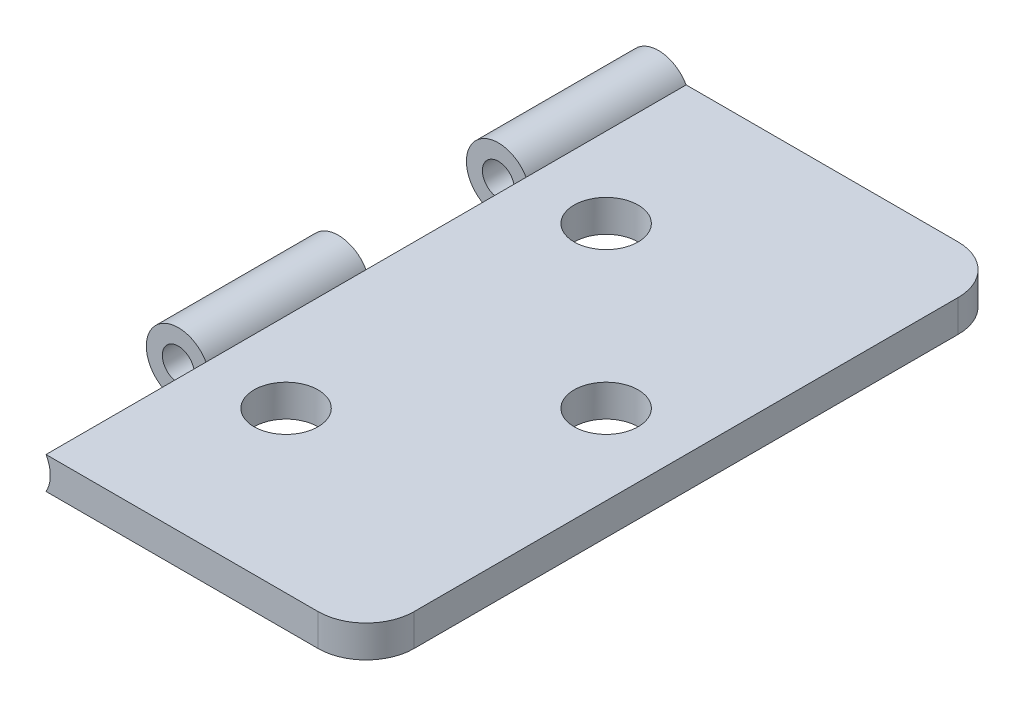
ISO-10303-21;
HEADER;
FILE_DESCRIPTION(('STEP AP214'),'2;1');
FILE_NAME('part.step','',(''),(''),'','','');
FILE_SCHEMA(('AUTOMOTIVE_DESIGN { 1 0 10303 214 1 1 1 1 }'));
ENDSEC;
DATA;
#1=APPLICATION_CONTEXT('core data for automotive mechanical design processes');
#2=APPLICATION_PROTOCOL_DEFINITION('international standard','automotive_design',2000,#1);
#3=PRODUCT_CONTEXT('',#1,'mechanical');
#4=PRODUCT('Part','Part','',(#3));
#5=PRODUCT_RELATED_PRODUCT_CATEGORY('part','',(#4));
#6=PRODUCT_DEFINITION_FORMATION('','',#4);
#7=PRODUCT_DEFINITION_CONTEXT('part definition',#1,'design');
#8=PRODUCT_DEFINITION('design','',#6,#7);
#9=PRODUCT_DEFINITION_SHAPE('','',#8);
#10=(LENGTH_UNIT() NAMED_UNIT(*) SI_UNIT(.MILLI.,.METRE.));
#11=(NAMED_UNIT(*) PLANE_ANGLE_UNIT() SI_UNIT($,.RADIAN.));
#12=(NAMED_UNIT(*) SI_UNIT($,.STERADIAN.) SOLID_ANGLE_UNIT());
#13=UNCERTAINTY_MEASURE_WITH_UNIT(LENGTH_MEASURE(1.E-05),#10,'distance_accuracy_value','');
#14=(GEOMETRIC_REPRESENTATION_CONTEXT(3) GLOBAL_UNCERTAINTY_ASSIGNED_CONTEXT((#13)) GLOBAL_UNIT_ASSIGNED_CONTEXT((#10,
#11,#12)) REPRESENTATION_CONTEXT('',''));
#15=CARTESIAN_POINT('',(0.,0.,0.));
#16=DIRECTION('',(0.,0.,1.));
#17=DIRECTION('',(1.,0.,0.));
#18=AXIS2_PLACEMENT_3D('',#15,#16,#17);
#19=CARTESIAN_POINT('',(11.7090081334901,-1.,-40.));
#20=DIRECTION('',(0.,0.,1.));
#21=DIRECTION('',(1.,0.,0.));
#22=AXIS2_PLACEMENT_3D('',#19,#20,#21);
#23=CYLINDRICAL_SURFACE('',#22,2.);
#24=DIRECTION('',(0.,0.,1.));
#25=VECTOR('',#24,1.);
#26=CARTESIAN_POINT('',(13.441058941059,0.,-40.));
#27=LINE('',#26,#25);
#28=CARTESIAN_POINT('',(13.441058941059,0.,-30.));
#29=VERTEX_POINT('',#28);
#30=CARTESIAN_POINT('',(13.441058941059,0.,-20.));
#31=VERTEX_POINT('',#30);
#32=EDGE_CURVE('E177',#29,#31,#27,.T.);
#33=ORIENTED_EDGE('',*,*,#32,.F.);
#34=CARTESIAN_POINT('',(11.7090081334901,-1.,-30.));
#35=DIRECTION('',(0.,0.,1.));
#36=DIRECTION('',(1.,0.,0.));
#37=AXIS2_PLACEMENT_3D('',#34,#35,#36);
#38=CIRCLE('',#37,2.);
#39=CARTESIAN_POINT('',(13.441058941059,-2.,-30.));
#40=VERTEX_POINT('',#39);
#41=EDGE_CURVE('E281',#40,#29,#38,.T.);
#42=ORIENTED_EDGE('',*,*,#41,.F.);
#43=DIRECTION('',(0.,0.,1.));
#44=VECTOR('',#43,1.);
#45=CARTESIAN_POINT('',(13.441058941059,-2.,-40.));
#46=LINE('',#45,#44);
#47=CARTESIAN_POINT('',(13.441058941059,-2.,-20.));
#48=VERTEX_POINT('',#47);
#49=EDGE_CURVE('E137',#40,#48,#46,.T.);
#50=ORIENTED_EDGE('',*,*,#49,.T.);
#51=CARTESIAN_POINT('',(11.7090081334901,-1.,-20.));
#52=DIRECTION('',(0.,0.,1.));
#53=DIRECTION('',(1.,0.,0.));
#54=AXIS2_PLACEMENT_3D('',#51,#52,#53);
#55=CIRCLE('',#54,2.);
#56=EDGE_CURVE('E195',#48,#31,#55,.T.);
#57=ORIENTED_EDGE('',*,*,#56,.T.);
#58=EDGE_LOOP('',(#33,#42,#50,#57));
#59=FACE_BOUND('',#58,.T.);
#60=ADVANCED_FACE('F39',(#59),#23,.F.);
#61=CARTESIAN_POINT('',(13.441058941059,0.,-10.));
#62=VERTEX_POINT('',#61);
#63=CARTESIAN_POINT('',(13.441058941059,0.,0.));
#64=VERTEX_POINT('',#63);
#65=EDGE_CURVE('E178',#62,#64,#27,.T.);
#66=ORIENTED_EDGE('',*,*,#65,.F.);
#67=CARTESIAN_POINT('',(11.7090081334901,-1.,-10.));
#68=DIRECTION('',(0.,0.,1.));
#69=DIRECTION('',(1.,0.,0.));
#70=AXIS2_PLACEMENT_3D('',#67,#68,#69);
#71=CIRCLE('',#70,2.);
#72=CARTESIAN_POINT('',(13.441058941059,-2.,-10.));
#73=VERTEX_POINT('',#72);
#74=EDGE_CURVE('E213',#73,#62,#71,.T.);
#75=ORIENTED_EDGE('',*,*,#74,.F.);
#76=CARTESIAN_POINT('',(13.441058941059,-2.,0.));
#77=VERTEX_POINT('',#76);
#78=EDGE_CURVE('E146',#73,#77,#46,.T.);
#79=ORIENTED_EDGE('',*,*,#78,.T.);
#80=CARTESIAN_POINT('',(11.7090081334901,-1.,0.));
#81=DIRECTION('',(0.,0.,1.));
#82=DIRECTION('',(1.,0.,0.));
#83=AXIS2_PLACEMENT_3D('',#80,#81,#82);
#84=CIRCLE('',#83,2.);
#85=EDGE_CURVE('E164',#77,#64,#84,.T.);
#86=ORIENTED_EDGE('',*,*,#85,.T.);
#87=EDGE_LOOP('',(#66,#75,#79,#86));
#88=FACE_BOUND('',#87,.T.);
#89=ADVANCED_FACE('F220',(#88),#23,.F.);
#90=CARTESIAN_POINT('',(0.,0.,-40.));
#91=DIRECTION('',(0.,-1.,0.));
#92=DIRECTION('',(0.,0.,-1.));
#93=AXIS2_PLACEMENT_3D('',#90,#91,#92);
#94=PLANE('',#93);
#95=CARTESIAN_POINT('',(18.441058941059,0.,-30.));
#96=DIRECTION('',(0.,1.,0.));
#97=DIRECTION('',(0.,0.,1.));
#98=AXIS2_PLACEMENT_3D('',#95,#96,#97);
#99=CIRCLE('',#98,2.);
#100=CARTESIAN_POINT('',(18.441058941059,0.,-28.));
#101=VERTEX_POINT('',#100);
#102=EDGE_CURVE('E258',#101,#101,#99,.T.);
#103=ORIENTED_EDGE('',*,*,#102,.F.);
#104=EDGE_LOOP('',(#103));
#105=FACE_BOUND('',#104,.T.);
#106=CARTESIAN_POINT('',(18.441058941059,0.,-10.));
#107=DIRECTION('',(0.,1.,0.));
#108=DIRECTION('',(0.,0.,1.));
#109=AXIS2_PLACEMENT_3D('',#106,#107,#108);
#110=CIRCLE('',#109,2.);
#111=CARTESIAN_POINT('',(18.441058941059,0.,-8.));
#112=VERTEX_POINT('',#111);
#113=EDGE_CURVE('E263',#112,#112,#110,.T.);
#114=ORIENTED_EDGE('',*,*,#113,.F.);
#115=EDGE_LOOP('',(#114));
#116=FACE_BOUND('',#115,.T.);
#117=CARTESIAN_POINT('',(28.441058941059,0.,-20.));
#118=DIRECTION('',(0.,1.,0.));
#119=DIRECTION('',(0.,0.,1.));
#120=AXIS2_PLACEMENT_3D('',#117,#118,#119);
#121=CIRCLE('',#120,2.00000000000001);
#122=CARTESIAN_POINT('',(28.441058941059,0.,-18.));
#123=VERTEX_POINT('',#122);
#124=EDGE_CURVE('E269',#123,#123,#121,.T.);
#125=ORIENTED_EDGE('',*,*,#124,.F.);
#126=EDGE_LOOP('',(#125));
#127=FACE_BOUND('',#126,.T.);
#128=DIRECTION('',(0.,0.,1.));
#129=VECTOR('',#128,1.);
#130=CARTESIAN_POINT('',(33.441058941059,0.,-40.));
#131=LINE('',#130,#129);
#132=CARTESIAN_POINT('',(33.441058941059,0.,-37.));
#133=VERTEX_POINT('',#132);
#134=CARTESIAN_POINT('',(33.441058941059,0.,-3.));
#135=VERTEX_POINT('',#134);
#136=EDGE_CURVE('E144',#133,#135,#131,.T.);
#137=ORIENTED_EDGE('',*,*,#136,.F.);
#138=CARTESIAN_POINT('',(30.441058941059,0.,-37.));
#139=DIRECTION('',(0.,-1.,0.));
#140=DIRECTION('',(0.,0.,-1.));
#141=AXIS2_PLACEMENT_3D('',#138,#139,#140);
#142=CIRCLE('',#141,3.);
#143=CARTESIAN_POINT('',(30.441058941059,0.,-40.));
#144=VERTEX_POINT('',#143);
#145=EDGE_CURVE('E11',#133,#144,#142,.F.);
#146=ORIENTED_EDGE('',*,*,#145,.T.);
#147=DIRECTION('',(1.,0.,0.));
#148=VECTOR('',#147,1.);
#149=CARTESIAN_POINT('',(0.,0.,-40.));
#150=LINE('',#149,#148);
#151=CARTESIAN_POINT('',(13.441058941059,0.,-40.));
#152=VERTEX_POINT('',#151);
#153=EDGE_CURVE('E119',#152,#144,#150,.T.);
#154=ORIENTED_EDGE('',*,*,#153,.F.);
#155=EDGE_CURVE('E128',#152,#29,#27,.T.);
#156=ORIENTED_EDGE('',*,*,#155,.T.);
#157=ORIENTED_EDGE('',*,*,#32,.T.);
#158=DIRECTION('',(0.,0.,1.));
#159=VECTOR('',#158,1.);
#160=CARTESIAN_POINT('',(13.441058941059,0.,-20.));
#161=LINE('',#160,#159);
#162=EDGE_CURVE('E168',#31,#62,#161,.T.);
#163=ORIENTED_EDGE('',*,*,#162,.T.);
#164=ORIENTED_EDGE('',*,*,#65,.T.);
#165=DIRECTION('',(1.,0.,0.));
#166=VECTOR('',#165,1.);
#167=CARTESIAN_POINT('',(0.,0.,0.));
#168=LINE('',#167,#166);
#169=CARTESIAN_POINT('',(30.441058941059,0.,0.));
#170=VERTEX_POINT('',#169);
#171=EDGE_CURVE('E120',#64,#170,#168,.T.);
#172=ORIENTED_EDGE('',*,*,#171,.T.);
#173=CARTESIAN_POINT('',(30.441058941059,0.,-3.));
#174=DIRECTION('',(0.,-1.,0.));
#175=DIRECTION('',(0.,0.,-1.));
#176=AXIS2_PLACEMENT_3D('',#173,#174,#175);
#177=CIRCLE('',#176,3.);
#178=EDGE_CURVE('E227',#170,#135,#177,.F.);
#179=ORIENTED_EDGE('',*,*,#178,.T.);
#180=EDGE_LOOP('',(#137,#146,#154,#156,#157,#163,#164,#172,#179));
#181=FACE_BOUND('',#180,.T.);
#182=ADVANCED_FACE('F189',(#105,#116,#127,#181),#94,.F.);
#183=CARTESIAN_POINT('',(33.441058941059,0.,-40.));
#184=DIRECTION('',(-1.,0.,0.));
#185=DIRECTION('',(0.,0.,1.));
#186=AXIS2_PLACEMENT_3D('',#183,#184,#185);
#187=PLANE('',#186);
#188=DIRECTION('',(0.,0.,1.));
#189=VECTOR('',#188,1.);
#190=CARTESIAN_POINT('',(33.441058941059,-2.,-40.));
#191=LINE('',#190,#189);
#192=CARTESIAN_POINT('',(33.441058941059,-2.,-37.));
#193=VERTEX_POINT('',#192);
#194=CARTESIAN_POINT('',(33.441058941059,-2.,-3.));
#195=VERTEX_POINT('',#194);
#196=EDGE_CURVE('E139',#193,#195,#191,.T.);
#197=ORIENTED_EDGE('',*,*,#196,.F.);
#198=DIRECTION('',(0.,-1.,0.));
#199=VECTOR('',#198,1.);
#200=CARTESIAN_POINT('',(33.441058941059,0.,-37.));
#201=LINE('',#200,#199);
#202=EDGE_CURVE('E48',#193,#133,#201,.F.);
#203=ORIENTED_EDGE('',*,*,#202,.T.);
#204=ORIENTED_EDGE('',*,*,#136,.T.);
#205=DIRECTION('',(0.,-1.,0.));
#206=VECTOR('',#205,1.);
#207=CARTESIAN_POINT('',(33.441058941059,-2.,-3.));
#208=LINE('',#207,#206);
#209=EDGE_CURVE('E176',#135,#195,#208,.T.);
#210=ORIENTED_EDGE('',*,*,#209,.T.);
#211=EDGE_LOOP('',(#197,#203,#204,#210));
#212=FACE_BOUND('',#211,.T.);
#213=ADVANCED_FACE('F327',(#212),#187,.F.);
#214=CARTESIAN_POINT('',(0.,-2.,-40.));
#215=DIRECTION('',(0.,1.,0.));
#216=DIRECTION('',(-1.,0.,0.));
#217=AXIS2_PLACEMENT_3D('',#214,#215,#216);
#218=PLANE('',#217);
#219=CARTESIAN_POINT('',(18.441058941059,-2.,-30.));
#220=DIRECTION('',(0.,1.,0.));
#221=DIRECTION('',(-1.,0.,0.));
#222=AXIS2_PLACEMENT_3D('',#219,#220,#221);
#223=CIRCLE('',#222,2.);
#224=CARTESIAN_POINT('',(16.441058941059,-2.,-30.));
#225=VERTEX_POINT('',#224);
#226=EDGE_CURVE('E247',#225,#225,#223,.T.);
#227=ORIENTED_EDGE('',*,*,#226,.T.);
#228=EDGE_LOOP('',(#227));
#229=FACE_BOUND('',#228,.T.);
#230=CARTESIAN_POINT('',(18.441058941059,-2.,-10.));
#231=DIRECTION('',(0.,1.,0.));
#232=DIRECTION('',(-1.,0.,0.));
#233=AXIS2_PLACEMENT_3D('',#230,#231,#232);
#234=CIRCLE('',#233,2.);
#235=CARTESIAN_POINT('',(16.441058941059,-2.,-10.));
#236=VERTEX_POINT('',#235);
#237=EDGE_CURVE('E252',#236,#236,#234,.T.);
#238=ORIENTED_EDGE('',*,*,#237,.T.);
#239=EDGE_LOOP('',(#238));
#240=FACE_BOUND('',#239,.T.);
#241=CARTESIAN_POINT('',(28.441058941059,-2.,-20.));
#242=DIRECTION('',(0.,1.,0.));
#243=DIRECTION('',(-1.,0.,0.));
#244=AXIS2_PLACEMENT_3D('',#241,#242,#243);
#245=CIRCLE('',#244,2.00000000000001);
#246=CARTESIAN_POINT('',(26.4410589410589,-2.,-20.));
#247=VERTEX_POINT('',#246);
#248=EDGE_CURVE('E255',#247,#247,#245,.T.);
#249=ORIENTED_EDGE('',*,*,#248,.T.);
#250=EDGE_LOOP('',(#249));
#251=FACE_BOUND('',#250,.T.);
#252=DIRECTION('',(-1.,0.,0.));
#253=VECTOR('',#252,1.);
#254=CARTESIAN_POINT('',(0.,-2.,-40.));
#255=LINE('',#254,#253);
#256=CARTESIAN_POINT('',(30.441058941059,-2.,-40.));
#257=VERTEX_POINT('',#256);
#258=CARTESIAN_POINT('',(13.441058941059,-2.,-40.));
#259=VERTEX_POINT('',#258);
#260=EDGE_CURVE('E108',#257,#259,#255,.T.);
#261=ORIENTED_EDGE('',*,*,#260,.F.);
#262=CARTESIAN_POINT('',(30.441058941059,-2.,-37.));
#263=DIRECTION('',(0.,1.,0.));
#264=DIRECTION('',(-1.,0.,0.));
#265=AXIS2_PLACEMENT_3D('',#262,#263,#264);
#266=CIRCLE('',#265,3.);
#267=EDGE_CURVE('E62',#257,#193,#266,.F.);
#268=ORIENTED_EDGE('',*,*,#267,.T.);
#269=ORIENTED_EDGE('',*,*,#196,.T.);
#270=CARTESIAN_POINT('',(30.441058941059,-2.,-3.));
#271=DIRECTION('',(0.,1.,0.));
#272=DIRECTION('',(-1.,0.,0.));
#273=AXIS2_PLACEMENT_3D('',#270,#271,#272);
#274=CIRCLE('',#273,3.);
#275=CARTESIAN_POINT('',(30.441058941059,-2.,0.));
#276=VERTEX_POINT('',#275);
#277=EDGE_CURVE('E237',#195,#276,#274,.F.);
#278=ORIENTED_EDGE('',*,*,#277,.T.);
#279=DIRECTION('',(-1.,0.,0.));
#280=VECTOR('',#279,1.);
#281=CARTESIAN_POINT('',(0.,-2.,0.));
#282=LINE('',#281,#280);
#283=EDGE_CURVE('E167',#276,#77,#282,.T.);
#284=ORIENTED_EDGE('',*,*,#283,.T.);
#285=ORIENTED_EDGE('',*,*,#78,.F.);
#286=EDGE_CURVE('E141',#48,#73,#46,.T.);
#287=ORIENTED_EDGE('',*,*,#286,.F.);
#288=ORIENTED_EDGE('',*,*,#49,.F.);
#289=EDGE_CURVE('E125',#259,#40,#46,.T.);
#290=ORIENTED_EDGE('',*,*,#289,.F.);
#291=EDGE_LOOP('',(#261,#268,#269,#278,#284,#285,#287,#288,#290));
#292=FACE_BOUND('',#291,.T.);
#293=ADVANCED_FACE('F135',(#229,#240,#251,#292),#218,.F.);
#294=CARTESIAN_POINT('',(0.,0.,-40.));
#295=DIRECTION('',(0.,0.,1.));
#296=DIRECTION('',(1.,0.,0.));
#297=AXIS2_PLACEMENT_3D('',#294,#295,#296);
#298=PLANE('',#297);
#299=ORIENTED_EDGE('',*,*,#153,.T.);
#300=DIRECTION('',(0.,-1.,0.));
#301=VECTOR('',#300,1.);
#302=CARTESIAN_POINT('',(30.441058941059,0.,-40.));
#303=LINE('',#302,#301);
#304=EDGE_CURVE('E116',#144,#257,#303,.T.);
#305=ORIENTED_EDGE('',*,*,#304,.T.);
#306=ORIENTED_EDGE('',*,*,#260,.T.);
#307=CARTESIAN_POINT('',(11.7090081334901,-1.,-40.));
#308=DIRECTION('',(0.,0.,1.));
#309=DIRECTION('',(1.,0.,0.));
#310=AXIS2_PLACEMENT_3D('',#307,#308,#309);
#311=CIRCLE('',#310,2.);
#312=EDGE_CURVE('E113',#152,#259,#311,.T.);
#313=ORIENTED_EDGE('',*,*,#312,.F.);
#314=EDGE_LOOP('',(#299,#305,#306,#313));
#315=FACE_BOUND('',#314,.T.);
#316=CARTESIAN_POINT('',(11.7090081334901,-1.,-40.));
#317=DIRECTION('',(0.,0.,1.));
#318=DIRECTION('',(1.,0.,0.));
#319=AXIS2_PLACEMENT_3D('',#316,#317,#318);
#320=CIRCLE('',#319,1.);
#321=CARTESIAN_POINT('',(12.7090081334901,-1.,-40.));
#322=VERTEX_POINT('',#321);
#323=EDGE_CURVE('E132',#322,#322,#320,.T.);
#324=ORIENTED_EDGE('',*,*,#323,.T.);
#325=EDGE_LOOP('',(#324));
#326=FACE_BOUND('',#325,.T.);
#327=ADVANCED_FACE('F111',(#315,#326),#298,.F.);
#328=CARTESIAN_POINT('',(0.,0.,0.));
#329=DIRECTION('',(0.,0.,1.));
#330=DIRECTION('',(1.,0.,0.));
#331=AXIS2_PLACEMENT_3D('',#328,#329,#330);
#332=PLANE('',#331);
#333=ORIENTED_EDGE('',*,*,#283,.F.);
#334=DIRECTION('',(0.,-1.,0.));
#335=VECTOR('',#334,1.);
#336=CARTESIAN_POINT('',(30.441058941059,0.,0.));
#337=LINE('',#336,#335);
#338=EDGE_CURVE('E225',#276,#170,#337,.F.);
#339=ORIENTED_EDGE('',*,*,#338,.T.);
#340=ORIENTED_EDGE('',*,*,#171,.F.);
#341=ORIENTED_EDGE('',*,*,#85,.F.);
#342=EDGE_LOOP('',(#333,#339,#340,#341));
#343=FACE_BOUND('',#342,.T.);
#344=ADVANCED_FACE('F223',(#343),#332,.T.);
#345=CARTESIAN_POINT('',(11.7090081334901,-1.,-20.));
#346=DIRECTION('',(0.,0.,1.));
#347=DIRECTION('',(1.,0.,0.));
#348=AXIS2_PLACEMENT_3D('',#345,#346,#347);
#349=CYLINDRICAL_SURFACE('',#348,2.);
#350=ORIENTED_EDGE('',*,*,#162,.F.);
#351=EDGE_CURVE('E199',#31,#48,#55,.T.);
#352=ORIENTED_EDGE('',*,*,#351,.T.);
#353=ORIENTED_EDGE('',*,*,#286,.T.);
#354=EDGE_CURVE('E203',#62,#73,#71,.T.);
#355=ORIENTED_EDGE('',*,*,#354,.F.);
#356=EDGE_LOOP('',(#350,#352,#353,#355));
#357=FACE_BOUND('',#356,.T.);
#358=ADVANCED_FACE('F202',(#357),#349,.T.);
#359=CARTESIAN_POINT('',(11.7090081334901,-1.,-20.));
#360=DIRECTION('',(0.,0.,1.));
#361=DIRECTION('',(1.,0.,0.));
#362=AXIS2_PLACEMENT_3D('',#359,#360,#361);
#363=CYLINDRICAL_SURFACE('',#362,1.);
#364=CARTESIAN_POINT('',(11.7090081334901,-1.,-20.));
#365=DIRECTION('',(0.,0.,1.));
#366=DIRECTION('',(1.,0.,0.));
#367=AXIS2_PLACEMENT_3D('',#364,#365,#366);
#368=CIRCLE('',#367,1.);
#369=CARTESIAN_POINT('',(12.7090081334901,-1.,-20.));
#370=VERTEX_POINT('',#369);
#371=EDGE_CURVE('E200',#370,#370,#368,.T.);
#372=ORIENTED_EDGE('',*,*,#371,.F.);
#373=EDGE_LOOP('',(#372));
#374=FACE_BOUND('',#373,.T.);
#375=CARTESIAN_POINT('',(11.7090081334901,-1.,-10.));
#376=DIRECTION('',(0.,0.,1.));
#377=DIRECTION('',(1.,0.,0.));
#378=AXIS2_PLACEMENT_3D('',#375,#376,#377);
#379=CIRCLE('',#378,1.);
#380=CARTESIAN_POINT('',(12.7090081334901,-1.,-10.));
#381=VERTEX_POINT('',#380);
#382=EDGE_CURVE('E131',#381,#381,#379,.T.);
#383=ORIENTED_EDGE('',*,*,#382,.T.);
#384=EDGE_LOOP('',(#383));
#385=FACE_BOUND('',#384,.T.);
#386=ADVANCED_FACE('F343',(#374,#385),#363,.F.);
#387=CARTESIAN_POINT('',(0.,0.,-20.));
#388=DIRECTION('',(0.,0.,1.));
#389=DIRECTION('',(1.,0.,0.));
#390=AXIS2_PLACEMENT_3D('',#387,#388,#389);
#391=PLANE('',#390);
#392=ORIENTED_EDGE('',*,*,#371,.T.);
#393=EDGE_LOOP('',(#392));
#394=FACE_BOUND('',#393,.T.);
#395=ORIENTED_EDGE('',*,*,#351,.F.);
#396=ORIENTED_EDGE('',*,*,#56,.F.);
#397=EDGE_LOOP('',(#395,#396));
#398=FACE_BOUND('',#397,.T.);
#399=ADVANCED_FACE('F205',(#394,#398),#391,.F.);
#400=CARTESIAN_POINT('',(0.,0.,-10.));
#401=DIRECTION('',(0.,0.,1.));
#402=DIRECTION('',(1.,0.,0.));
#403=AXIS2_PLACEMENT_3D('',#400,#401,#402);
#404=PLANE('',#403);
#405=ORIENTED_EDGE('',*,*,#382,.F.);
#406=EDGE_LOOP('',(#405));
#407=FACE_BOUND('',#406,.T.);
#408=ORIENTED_EDGE('',*,*,#354,.T.);
#409=ORIENTED_EDGE('',*,*,#74,.T.);
#410=EDGE_LOOP('',(#408,#409));
#411=FACE_BOUND('',#410,.T.);
#412=ADVANCED_FACE('F219',(#407,#411),#404,.T.);
#413=CARTESIAN_POINT('',(11.7090081334901,-1.,-40.));
#414=DIRECTION('',(0.,0.,1.));
#415=DIRECTION('',(1.,0.,0.));
#416=AXIS2_PLACEMENT_3D('',#413,#414,#415);
#417=CYLINDRICAL_SURFACE('',#416,2.);
#418=ORIENTED_EDGE('',*,*,#155,.F.);
#419=ORIENTED_EDGE('',*,*,#312,.T.);
#420=ORIENTED_EDGE('',*,*,#289,.T.);
#421=EDGE_CURVE('E277',#29,#40,#38,.T.);
#422=ORIENTED_EDGE('',*,*,#421,.F.);
#423=EDGE_LOOP('',(#418,#419,#420,#422));
#424=FACE_BOUND('',#423,.T.);
#425=ADVANCED_FACE('F123',(#424),#417,.T.);
#426=CARTESIAN_POINT('',(11.7090081334901,-1.,-40.));
#427=DIRECTION('',(0.,0.,1.));
#428=DIRECTION('',(1.,0.,0.));
#429=AXIS2_PLACEMENT_3D('',#426,#427,#428);
#430=CYLINDRICAL_SURFACE('',#429,1.);
#431=ORIENTED_EDGE('',*,*,#323,.F.);
#432=EDGE_LOOP('',(#431));
#433=FACE_BOUND('',#432,.T.);
#434=CARTESIAN_POINT('',(11.7090081334901,-1.,-30.));
#435=DIRECTION('',(0.,0.,1.));
#436=DIRECTION('',(1.,0.,0.));
#437=AXIS2_PLACEMENT_3D('',#434,#435,#436);
#438=CIRCLE('',#437,1.);
#439=CARTESIAN_POINT('',(12.7090081334901,-1.,-30.));
#440=VERTEX_POINT('',#439);
#441=EDGE_CURVE('E251',#440,#440,#438,.T.);
#442=ORIENTED_EDGE('',*,*,#441,.T.);
#443=EDGE_LOOP('',(#442));
#444=FACE_BOUND('',#443,.T.);
#445=ADVANCED_FACE('F288',(#433,#444),#430,.F.);
#446=CARTESIAN_POINT('',(0.,0.,-30.));
#447=DIRECTION('',(0.,0.,1.));
#448=DIRECTION('',(1.,0.,0.));
#449=AXIS2_PLACEMENT_3D('',#446,#447,#448);
#450=PLANE('',#449);
#451=ORIENTED_EDGE('',*,*,#441,.F.);
#452=EDGE_LOOP('',(#451));
#453=FACE_BOUND('',#452,.T.);
#454=ORIENTED_EDGE('',*,*,#421,.T.);
#455=ORIENTED_EDGE('',*,*,#41,.T.);
#456=EDGE_LOOP('',(#454,#455));
#457=FACE_BOUND('',#456,.T.);
#458=ADVANCED_FACE('F285',(#453,#457),#450,.T.);
#459=CARTESIAN_POINT('',(28.441058941059,-10.,-20.));
#460=DIRECTION('',(0.,1.,0.));
#461=DIRECTION('',(0.,0.,1.));
#462=AXIS2_PLACEMENT_3D('',#459,#460,#461);
#463=CYLINDRICAL_SURFACE('',#462,2.00000000000001);
#464=ORIENTED_EDGE('',*,*,#124,.T.);
#465=EDGE_LOOP('',(#464));
#466=FACE_BOUND('',#465,.T.);
#467=ORIENTED_EDGE('',*,*,#248,.F.);
#468=EDGE_LOOP('',(#467));
#469=FACE_BOUND('',#468,.T.);
#470=ADVANCED_FACE('F287',(#466,#469),#463,.F.);
#471=CARTESIAN_POINT('',(18.441058941059,-10.,-10.));
#472=DIRECTION('',(0.,1.,0.));
#473=DIRECTION('',(0.,0.,1.));
#474=AXIS2_PLACEMENT_3D('',#471,#472,#473);
#475=CYLINDRICAL_SURFACE('',#474,2.);
#476=ORIENTED_EDGE('',*,*,#113,.T.);
#477=EDGE_LOOP('',(#476));
#478=FACE_BOUND('',#477,.T.);
#479=ORIENTED_EDGE('',*,*,#237,.F.);
#480=EDGE_LOOP('',(#479));
#481=FACE_BOUND('',#480,.T.);
#482=ADVANCED_FACE('F295',(#478,#481),#475,.F.);
#483=CARTESIAN_POINT('',(18.441058941059,-10.,-30.));
#484=DIRECTION('',(0.,1.,0.));
#485=DIRECTION('',(0.,0.,1.));
#486=AXIS2_PLACEMENT_3D('',#483,#484,#485);
#487=CYLINDRICAL_SURFACE('',#486,2.);
#488=ORIENTED_EDGE('',*,*,#102,.T.);
#489=EDGE_LOOP('',(#488));
#490=FACE_BOUND('',#489,.T.);
#491=ORIENTED_EDGE('',*,*,#226,.F.);
#492=EDGE_LOOP('',(#491));
#493=FACE_BOUND('',#492,.T.);
#494=ADVANCED_FACE('F310',(#490,#493),#487,.F.);
#495=CARTESIAN_POINT('',(30.441058941059,0.,-3.));
#496=DIRECTION('',(0.,1.,0.));
#497=DIRECTION('',(0.,0.,1.));
#498=AXIS2_PLACEMENT_3D('',#495,#496,#497);
#499=CYLINDRICAL_SURFACE('',#498,3.);
#500=ORIENTED_EDGE('',*,*,#178,.F.);
#501=ORIENTED_EDGE('',*,*,#338,.F.);
#502=ORIENTED_EDGE('',*,*,#277,.F.);
#503=ORIENTED_EDGE('',*,*,#209,.F.);
#504=EDGE_LOOP('',(#500,#501,#502,#503));
#505=FACE_BOUND('',#504,.T.);
#506=ADVANCED_FACE('F230',(#505),#499,.T.);
#507=CARTESIAN_POINT('',(30.441058941059,0.,-37.));
#508=DIRECTION('',(0.,-1.,0.));
#509=DIRECTION('',(0.,0.,-1.));
#510=AXIS2_PLACEMENT_3D('',#507,#508,#509);
#511=CYLINDRICAL_SURFACE('',#510,3.);
#512=ORIENTED_EDGE('',*,*,#145,.F.);
#513=ORIENTED_EDGE('',*,*,#202,.F.);
#514=ORIENTED_EDGE('',*,*,#267,.F.);
#515=ORIENTED_EDGE('',*,*,#304,.F.);
#516=EDGE_LOOP('',(#512,#513,#514,#515));
#517=FACE_BOUND('',#516,.T.);
#518=ADVANCED_FACE('F41',(#517),#511,.T.);
#519=CLOSED_SHELL('',(#60,#89,#182,#213,#293,#327,#344,#358,#386,#399,#412,#425,#445,#458,#470,
#482,#494,#506,#518));
#520=MANIFOLD_SOLID_BREP('B2',#519);
#521=ADVANCED_BREP_SHAPE_REPRESENTATION('',(#18,#520),#14);
#522=SHAPE_DEFINITION_REPRESENTATION(#9,#521);
ENDSEC;
END-ISO-10303-21;
